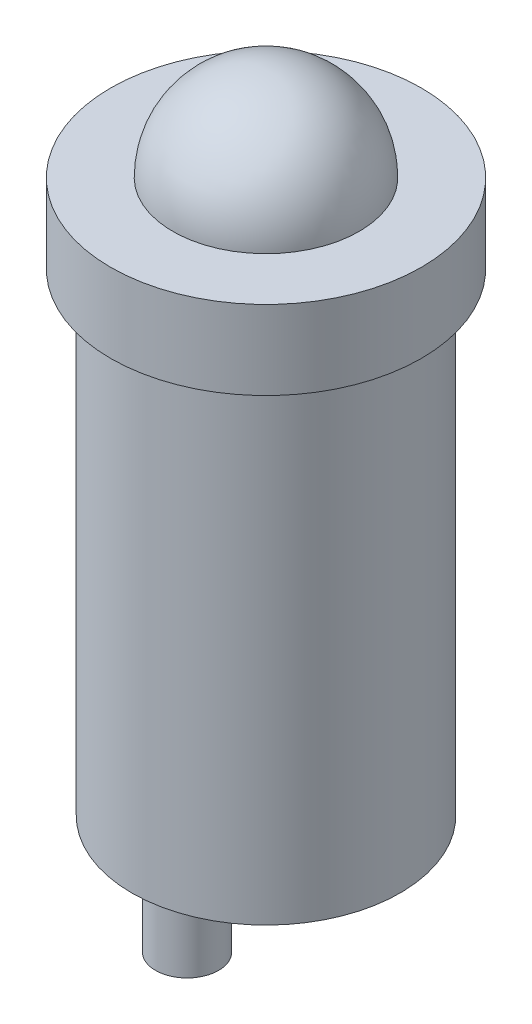
ISO-10303-21;
HEADER;
FILE_DESCRIPTION(('STEP AP214'),'2;1');
FILE_NAME('part.step','',(''),(''),'','','');
FILE_SCHEMA(('AUTOMOTIVE_DESIGN { 1 0 10303 214 1 1 1 1 }'));
ENDSEC;
DATA;
#1=APPLICATION_CONTEXT('core data for automotive mechanical design processes');
#2=APPLICATION_PROTOCOL_DEFINITION('international standard','automotive_design',2000,#1);
#3=PRODUCT_CONTEXT('',#1,'mechanical');
#4=PRODUCT('Part','Part','',(#3));
#5=PRODUCT_RELATED_PRODUCT_CATEGORY('part','',(#4));
#6=PRODUCT_DEFINITION_FORMATION('','',#4);
#7=PRODUCT_DEFINITION_CONTEXT('part definition',#1,'design');
#8=PRODUCT_DEFINITION('design','',#6,#7);
#9=PRODUCT_DEFINITION_SHAPE('','',#8);
#10=(LENGTH_UNIT() NAMED_UNIT(*) SI_UNIT(.MILLI.,.METRE.));
#11=(NAMED_UNIT(*) PLANE_ANGLE_UNIT() SI_UNIT($,.RADIAN.));
#12=(NAMED_UNIT(*) SI_UNIT($,.STERADIAN.) SOLID_ANGLE_UNIT());
#13=UNCERTAINTY_MEASURE_WITH_UNIT(LENGTH_MEASURE(1.E-05),#10,'distance_accuracy_value','');
#14=(GEOMETRIC_REPRESENTATION_CONTEXT(3) GLOBAL_UNCERTAINTY_ASSIGNED_CONTEXT((#13)) GLOBAL_UNIT_ASSIGNED_CONTEXT((#10,
#11,#12)) REPRESENTATION_CONTEXT('',''));
#15=CARTESIAN_POINT('',(0.,0.,0.));
#16=DIRECTION('',(0.,0.,1.));
#17=DIRECTION('',(1.,0.,0.));
#18=AXIS2_PLACEMENT_3D('',#15,#16,#17);
#19=CARTESIAN_POINT('',(0.,-1.27,-1.27));
#20=DIRECTION('',(0.,1.,0.));
#21=DIRECTION('',(0.,0.,1.));
#22=AXIS2_PLACEMENT_3D('',#19,#20,#21);
#23=CYLINDRICAL_SURFACE('',#22,0.508);
#24=CARTESIAN_POINT('',(0.,-1.27,-1.27));
#25=DIRECTION('',(0.,-1.,0.));
#26=DIRECTION('',(0.,0.,1.));
#27=AXIS2_PLACEMENT_3D('',#24,#25,#26);
#28=CIRCLE('',#27,0.508);
#29=CARTESIAN_POINT('',(0.,-1.27,-0.761999999999999));
#30=VERTEX_POINT('',#29);
#31=EDGE_CURVE('E11',#30,#30,#28,.T.);
#32=ORIENTED_EDGE('',*,*,#31,.F.);
#33=EDGE_LOOP('',(#32));
#34=FACE_BOUND('',#33,.T.);
#35=CARTESIAN_POINT('',(0.,0.,-1.27));
#36=DIRECTION('',(0.,-1.,0.));
#37=DIRECTION('',(0.,0.,1.));
#38=AXIS2_PLACEMENT_3D('',#35,#36,#37);
#39=CIRCLE('',#38,0.508);
#40=CARTESIAN_POINT('',(0.,0.,-0.761999999999999));
#41=VERTEX_POINT('',#40);
#42=EDGE_CURVE('E45',#41,#41,#39,.T.);
#43=ORIENTED_EDGE('',*,*,#42,.T.);
#44=EDGE_LOOP('',(#43));
#45=FACE_BOUND('',#44,.T.);
#46=ADVANCED_FACE('F42',(#34,#45),#23,.T.);
#47=CARTESIAN_POINT('',(0.,-1.27,-1.27));
#48=DIRECTION('',(0.,1.,0.));
#49=DIRECTION('',(0.,0.,1.));
#50=AXIS2_PLACEMENT_3D('',#47,#48,#49);
#51=PLANE('',#50);
#52=ORIENTED_EDGE('',*,*,#31,.T.);
#53=EDGE_LOOP('',(#52));
#54=FACE_BOUND('',#53,.T.);
#55=ADVANCED_FACE('F57',(#54),#51,.F.);
#56=CARTESIAN_POINT('',(0.,0.,-1.27));
#57=DIRECTION('',(0.,1.,0.));
#58=DIRECTION('',(0.,0.,1.));
#59=AXIS2_PLACEMENT_3D('',#56,#57,#58);
#60=PLANE('',#59);
#61=ORIENTED_EDGE('',*,*,#42,.F.);
#62=EDGE_LOOP('',(#61));
#63=FACE_BOUND('',#62,.T.);
#64=ADVANCED_FACE('F55',(#63),#60,.T.);
#65=CLOSED_SHELL('',(#46,#55,#64));
#66=MANIFOLD_SOLID_BREP('B2',#65);
#67=CARTESIAN_POINT('',(0.,-1.27,1.27));
#68=DIRECTION('',(0.,1.,0.));
#69=DIRECTION('',(0.,0.,1.));
#70=AXIS2_PLACEMENT_3D('',#67,#68,#69);
#71=CYLINDRICAL_SURFACE('',#70,0.508);
#72=CARTESIAN_POINT('',(0.,-1.27,1.27));
#73=DIRECTION('',(0.,-1.,0.));
#74=DIRECTION('',(0.,0.,-1.));
#75=AXIS2_PLACEMENT_3D('',#72,#73,#74);
#76=CIRCLE('',#75,0.508);
#77=CARTESIAN_POINT('',(0.,-1.27,0.761999999999999));
#78=VERTEX_POINT('',#77);
#79=EDGE_CURVE('E41',#78,#78,#76,.T.);
#80=ORIENTED_EDGE('',*,*,#79,.F.);
#81=EDGE_LOOP('',(#80));
#82=FACE_BOUND('',#81,.T.);
#83=CARTESIAN_POINT('',(0.,0.,1.27));
#84=DIRECTION('',(0.,-1.,0.));
#85=DIRECTION('',(0.,0.,-1.));
#86=AXIS2_PLACEMENT_3D('',#83,#84,#85);
#87=CIRCLE('',#86,0.508);
#88=CARTESIAN_POINT('',(0.,0.,0.761999999999999));
#89=VERTEX_POINT('',#88);
#90=EDGE_CURVE('E94',#89,#89,#87,.T.);
#91=ORIENTED_EDGE('',*,*,#90,.T.);
#92=EDGE_LOOP('',(#91));
#93=FACE_BOUND('',#92,.T.);
#94=ADVANCED_FACE('F91',(#82,#93),#71,.T.);
#95=CARTESIAN_POINT('',(0.,-1.27,1.27));
#96=DIRECTION('',(0.,-1.,0.));
#97=DIRECTION('',(0.,0.,-1.));
#98=AXIS2_PLACEMENT_3D('',#95,#96,#97);
#99=PLANE('',#98);
#100=ORIENTED_EDGE('',*,*,#79,.T.);
#101=EDGE_LOOP('',(#100));
#102=FACE_BOUND('',#101,.T.);
#103=ADVANCED_FACE('F106',(#102),#99,.T.);
#104=CARTESIAN_POINT('',(0.,0.,1.27));
#105=DIRECTION('',(0.,-1.,0.));
#106=DIRECTION('',(0.,0.,-1.));
#107=AXIS2_PLACEMENT_3D('',#104,#105,#106);
#108=PLANE('',#107);
#109=ORIENTED_EDGE('',*,*,#90,.F.);
#110=EDGE_LOOP('',(#109));
#111=FACE_BOUND('',#110,.T.);
#112=ADVANCED_FACE('F104',(#111),#108,.F.);
#113=CLOSED_SHELL('',(#94,#103,#112));
#114=MANIFOLD_SOLID_BREP('B6',#113);
#115=CARTESIAN_POINT('',(0.,8.89,0.));
#116=DIRECTION('',(-1.,0.,0.));
#117=DIRECTION('',(0.,0.,1.));
#118=AXIS2_PLACEMENT_3D('',#115,#116,#117);
#119=SPHERICAL_SURFACE('',#118,1.5);
#120=CARTESIAN_POINT('',(0.,8.89,0.));
#121=DIRECTION('',(0.,-1.,0.));
#122=DIRECTION('',(0.,0.,-1.));
#123=AXIS2_PLACEMENT_3D('',#120,#121,#122);
#124=SPHERICAL_SURFACE('',#123,1.5);
#125=CARTESIAN_POINT('',(0.,8.89,0.));
#126=DIRECTION('',(0.,-1.,0.));
#127=DIRECTION('',(0.,0.,-1.));
#128=AXIS2_PLACEMENT_3D('',#125,#126,#127);
#129=CIRCLE('',#128,1.5);
#130=CARTESIAN_POINT('',(0.,8.89000000000001,-1.5));
#131=VERTEX_POINT('',#130);
#132=EDGE_CURVE('E90',#131,#131,#129,.T.);
#133=ORIENTED_EDGE('',*,*,#132,.F.);
#134=EDGE_LOOP('',(#133));
#135=FACE_BOUND('',#134,.T.);
#136=ADVANCED_FACE('F139',(#135),#124,.T.);
#137=CARTESIAN_POINT('',(0.,8.89,0.));
#138=DIRECTION('',(0.,-1.,0.));
#139=DIRECTION('',(0.,0.,-1.));
#140=AXIS2_PLACEMENT_3D('',#137,#138,#139);
#141=PLANE('',#140);
#142=ORIENTED_EDGE('',*,*,#132,.T.);
#143=EDGE_LOOP('',(#142));
#144=FACE_BOUND('',#143,.T.);
#145=ADVANCED_FACE('F146',(#144),#141,.T.);
#146=CLOSED_SHELL('',(#136,#145));
#147=MANIFOLD_SOLID_BREP('B36',#146);
#148=CARTESIAN_POINT('',(0.,7.62,0.));
#149=DIRECTION('',(0.,-1.,0.));
#150=DIRECTION('',(0.,0.,-1.));
#151=AXIS2_PLACEMENT_3D('',#148,#149,#150);
#152=CYLINDRICAL_SURFACE('',#151,2.16);
#153=CARTESIAN_POINT('',(0.,7.62,0.));
#154=DIRECTION('',(0.,1.,0.));
#155=DIRECTION('',(0.,0.,1.));
#156=AXIS2_PLACEMENT_3D('',#153,#154,#155);
#157=CIRCLE('',#156,2.16);
#158=CARTESIAN_POINT('',(0.,7.62,2.16));
#159=VERTEX_POINT('',#158);
#160=EDGE_CURVE('E138',#159,#159,#157,.T.);
#161=ORIENTED_EDGE('',*,*,#160,.F.);
#162=EDGE_LOOP('',(#161));
#163=FACE_BOUND('',#162,.T.);
#164=CARTESIAN_POINT('',(0.,0.,0.));
#165=DIRECTION('',(0.,1.,0.));
#166=DIRECTION('',(0.,0.,1.));
#167=AXIS2_PLACEMENT_3D('',#164,#165,#166);
#168=CIRCLE('',#167,2.16);
#169=CARTESIAN_POINT('',(0.,0.,2.16));
#170=VERTEX_POINT('',#169);
#171=EDGE_CURVE('E171',#170,#170,#168,.T.);
#172=ORIENTED_EDGE('',*,*,#171,.T.);
#173=EDGE_LOOP('',(#172));
#174=FACE_BOUND('',#173,.T.);
#175=ADVANCED_FACE('F168',(#163,#174),#152,.T.);
#176=CARTESIAN_POINT('',(0.,0.,0.));
#177=DIRECTION('',(0.,1.,0.));
#178=DIRECTION('',(0.,0.,1.));
#179=AXIS2_PLACEMENT_3D('',#176,#177,#178);
#180=PLANE('',#179);
#181=ORIENTED_EDGE('',*,*,#171,.F.);
#182=EDGE_LOOP('',(#181));
#183=FACE_BOUND('',#182,.T.);
#184=ADVANCED_FACE('F191',(#183),#180,.F.);
#185=CARTESIAN_POINT('',(0.,8.89,0.));
#186=DIRECTION('',(0.,-1.,0.));
#187=DIRECTION('',(0.,0.,-1.));
#188=AXIS2_PLACEMENT_3D('',#185,#186,#187);
#189=CYLINDRICAL_SURFACE('',#188,2.5);
#190=CARTESIAN_POINT('',(0.,8.89,0.));
#191=DIRECTION('',(0.,1.,0.));
#192=DIRECTION('',(0.,0.,1.));
#193=AXIS2_PLACEMENT_3D('',#190,#191,#192);
#194=CIRCLE('',#193,2.5);
#195=CARTESIAN_POINT('',(0.,8.89,2.5));
#196=VERTEX_POINT('',#195);
#197=EDGE_CURVE('E178',#196,#196,#194,.T.);
#198=ORIENTED_EDGE('',*,*,#197,.F.);
#199=EDGE_LOOP('',(#198));
#200=FACE_BOUND('',#199,.T.);
#201=CARTESIAN_POINT('',(0.,7.62,0.));
#202=DIRECTION('',(0.,1.,0.));
#203=DIRECTION('',(0.,0.,1.));
#204=AXIS2_PLACEMENT_3D('',#201,#202,#203);
#205=CIRCLE('',#204,2.5);
#206=CARTESIAN_POINT('',(0.,7.62,2.5));
#207=VERTEX_POINT('',#206);
#208=EDGE_CURVE('E180',#207,#207,#205,.T.);
#209=ORIENTED_EDGE('',*,*,#208,.T.);
#210=EDGE_LOOP('',(#209));
#211=FACE_BOUND('',#210,.T.);
#212=ADVANCED_FACE('F188',(#200,#211),#189,.T.);
#213=CARTESIAN_POINT('',(0.,8.89,0.));
#214=DIRECTION('',(0.,1.,0.));
#215=DIRECTION('',(0.,0.,1.));
#216=AXIS2_PLACEMENT_3D('',#213,#214,#215);
#217=PLANE('',#216);
#218=ORIENTED_EDGE('',*,*,#197,.T.);
#219=EDGE_LOOP('',(#218));
#220=FACE_BOUND('',#219,.T.);
#221=ADVANCED_FACE('F186',(#220),#217,.T.);
#222=CARTESIAN_POINT('',(0.,7.62,0.));
#223=DIRECTION('',(0.,1.,0.));
#224=DIRECTION('',(0.,0.,1.));
#225=AXIS2_PLACEMENT_3D('',#222,#223,#224);
#226=PLANE('',#225);
#227=ORIENTED_EDGE('',*,*,#160,.T.);
#228=EDGE_LOOP('',(#227));
#229=FACE_BOUND('',#228,.T.);
#230=ORIENTED_EDGE('',*,*,#208,.F.);
#231=EDGE_LOOP('',(#230));
#232=FACE_BOUND('',#231,.T.);
#233=ADVANCED_FACE('F195',(#229,#232),#226,.F.);
#234=CLOSED_SHELL('',(#175,#184,#212,#221,#233));
#235=MANIFOLD_SOLID_BREP('B85',#234);
#236=ADVANCED_BREP_SHAPE_REPRESENTATION('',(#18,#66,#114,#147,#235),#14);
#237=SHAPE_DEFINITION_REPRESENTATION(#9,#236);
ENDSEC;
END-ISO-10303-21;
